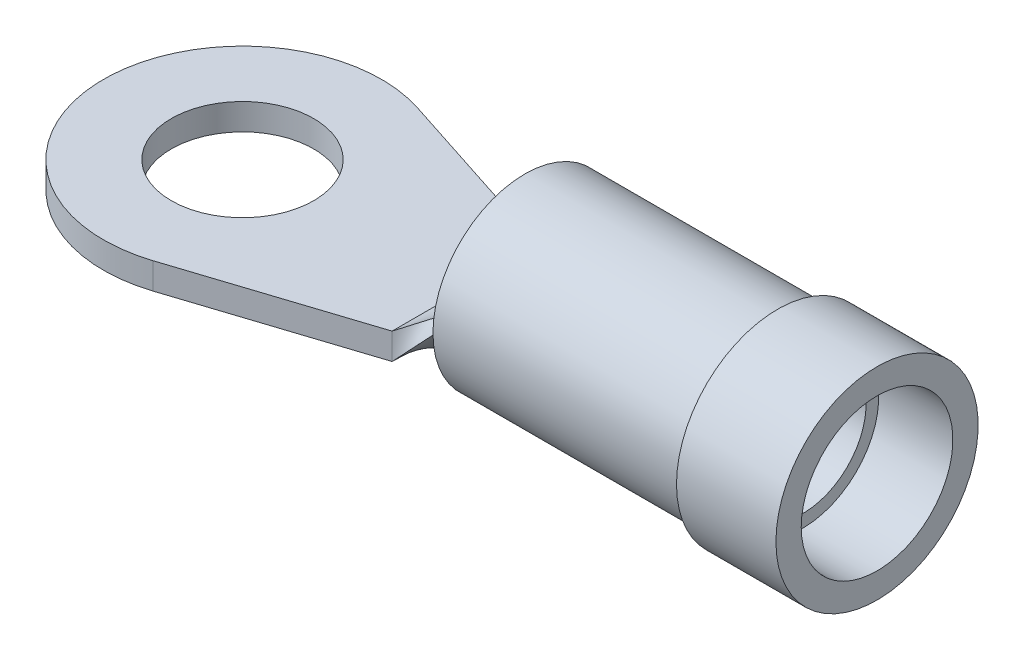
ISO-10303-21;
HEADER;
FILE_DESCRIPTION(('STEP AP214'),'2;1');
FILE_NAME('part.step','',(''),(''),'','','');
FILE_SCHEMA(('AUTOMOTIVE_DESIGN { 1 0 10303 214 1 1 1 1 }'));
ENDSEC;
DATA;
#1=APPLICATION_CONTEXT('core data for automotive mechanical design processes');
#2=APPLICATION_PROTOCOL_DEFINITION('international standard','automotive_design',2000,#1);
#3=PRODUCT_CONTEXT('',#1,'mechanical');
#4=PRODUCT('Part','Part','',(#3));
#5=PRODUCT_RELATED_PRODUCT_CATEGORY('part','',(#4));
#6=PRODUCT_DEFINITION_FORMATION('','',#4);
#7=PRODUCT_DEFINITION_CONTEXT('part definition',#1,'design');
#8=PRODUCT_DEFINITION('design','',#6,#7);
#9=PRODUCT_DEFINITION_SHAPE('','',#8);
#10=(LENGTH_UNIT() NAMED_UNIT(*) SI_UNIT(.MILLI.,.METRE.));
#11=(NAMED_UNIT(*) PLANE_ANGLE_UNIT() SI_UNIT($,.RADIAN.));
#12=(NAMED_UNIT(*) SI_UNIT($,.STERADIAN.) SOLID_ANGLE_UNIT());
#13=UNCERTAINTY_MEASURE_WITH_UNIT(LENGTH_MEASURE(1.E-05),#10,'distance_accuracy_value','');
#14=(GEOMETRIC_REPRESENTATION_CONTEXT(3) GLOBAL_UNCERTAINTY_ASSIGNED_CONTEXT((#13)) GLOBAL_UNIT_ASSIGNED_CONTEXT((#10,
#11,#12)) REPRESENTATION_CONTEXT('',''));
#15=CARTESIAN_POINT('',(0.,0.,0.));
#16=DIRECTION('',(0.,0.,1.));
#17=DIRECTION('',(1.,0.,0.));
#18=AXIS2_PLACEMENT_3D('',#15,#16,#17);
#19=CARTESIAN_POINT('',(8.509,-1.65735,0.));
#20=DIRECTION('',(-1.,0.,0.));
#21=DIRECTION('',(0.,0.,1.));
#22=AXIS2_PLACEMENT_3D('',#19,#20,#21);
#23=PLANE('',#22);
#24=CARTESIAN_POINT('',(8.509,1.11125,0.));
#25=DIRECTION('',(-1.,0.,0.));
#26=DIRECTION('',(0.,0.,1.));
#27=AXIS2_PLACEMENT_3D('',#24,#25,#26);
#28=CIRCLE('',#27,2.7686);
#29=CARTESIAN_POINT('',(8.509,1.11125,2.7686));
#30=VERTEX_POINT('',#29);
#31=EDGE_CURVE('E358',#30,#30,#28,.T.);
#32=ORIENTED_EDGE('',*,*,#31,.T.);
#33=EDGE_LOOP('',(#32));
#34=FACE_BOUND('',#33,.T.);
#35=CARTESIAN_POINT('',(8.509,1.11125,0.));
#36=DIRECTION('',(-1.,0.,0.));
#37=DIRECTION('',(0.,0.,1.));
#38=AXIS2_PLACEMENT_3D('',#35,#36,#37);
#39=CIRCLE('',#38,1.905);
#40=CARTESIAN_POINT('',(8.509,1.11125,1.905));
#41=VERTEX_POINT('',#40);
#42=EDGE_CURVE('E12',#41,#41,#39,.T.);
#43=ORIENTED_EDGE('',*,*,#42,.F.);
#44=EDGE_LOOP('',(#43));
#45=FACE_BOUND('',#44,.T.);
#46=ADVANCED_FACE('F330',(#34,#45),#23,.T.);
#47=CARTESIAN_POINT('',(5.55851083591331,1.11125,0.));
#48=DIRECTION('',(-1.,0.,0.));
#49=DIRECTION('',(0.,0.,1.));
#50=AXIS2_PLACEMENT_3D('',#47,#48,#49);
#51=CYLINDRICAL_SURFACE('',#50,1.905);
#52=ORIENTED_EDGE('',*,*,#42,.T.);
#53=EDGE_LOOP('',(#52));
#54=FACE_BOUND('',#53,.T.);
#55=CARTESIAN_POINT('',(16.891,1.11125,0.));
#56=DIRECTION('',(-1.,0.,0.));
#57=DIRECTION('',(0.,0.,1.));
#58=AXIS2_PLACEMENT_3D('',#55,#56,#57);
#59=CIRCLE('',#58,1.905);
#60=CARTESIAN_POINT('',(16.891,1.11125,1.905));
#61=VERTEX_POINT('',#60);
#62=EDGE_CURVE('E336',#61,#61,#59,.T.);
#63=ORIENTED_EDGE('',*,*,#62,.F.);
#64=EDGE_LOOP('',(#63));
#65=FACE_BOUND('',#64,.T.);
#66=ADVANCED_FACE('F376',(#54,#65),#51,.F.);
#67=CARTESIAN_POINT('',(16.891,-1.17475,0.));
#68=DIRECTION('',(1.,0.,0.));
#69=DIRECTION('',(0.,0.,-1.));
#70=AXIS2_PLACEMENT_3D('',#67,#68,#69);
#71=PLANE('',#70);
#72=ORIENTED_EDGE('',*,*,#62,.T.);
#73=EDGE_LOOP('',(#72));
#74=FACE_BOUND('',#73,.T.);
#75=CARTESIAN_POINT('',(16.891,1.11125,0.));
#76=DIRECTION('',(-1.,0.,0.));
#77=DIRECTION('',(0.,0.,1.));
#78=AXIS2_PLACEMENT_3D('',#75,#76,#77);
#79=CIRCLE('',#78,2.286);
#80=CARTESIAN_POINT('',(16.891,1.11125,2.286));
#81=VERTEX_POINT('',#80);
#82=EDGE_CURVE('E340',#81,#81,#79,.T.);
#83=ORIENTED_EDGE('',*,*,#82,.F.);
#84=EDGE_LOOP('',(#83));
#85=FACE_BOUND('',#84,.T.);
#86=ADVANCED_FACE('F380',(#74,#85),#71,.T.);
#87=CARTESIAN_POINT('',(5.55851083591331,1.11125,0.));
#88=DIRECTION('',(-1.,0.,0.));
#89=DIRECTION('',(0.,0.,1.));
#90=AXIS2_PLACEMENT_3D('',#87,#88,#89);
#91=CYLINDRICAL_SURFACE('',#90,2.286);
#92=ORIENTED_EDGE('',*,*,#82,.T.);
#93=EDGE_LOOP('',(#92));
#94=FACE_BOUND('',#93,.T.);
#95=CARTESIAN_POINT('',(19.1262,1.11125,0.));
#96=DIRECTION('',(-1.,0.,0.));
#97=DIRECTION('',(0.,0.,1.));
#98=AXIS2_PLACEMENT_3D('',#95,#96,#97);
#99=CIRCLE('',#98,2.286);
#100=CARTESIAN_POINT('',(19.1262,1.11125,2.286));
#101=VERTEX_POINT('',#100);
#102=EDGE_CURVE('E344',#101,#101,#99,.T.);
#103=ORIENTED_EDGE('',*,*,#102,.F.);
#104=EDGE_LOOP('',(#103));
#105=FACE_BOUND('',#104,.T.);
#106=ADVANCED_FACE('F384',(#94,#105),#91,.F.);
#107=CARTESIAN_POINT('',(19.1262,-1.93675,0.));
#108=DIRECTION('',(1.,0.,0.));
#109=DIRECTION('',(0.,0.,-1.));
#110=AXIS2_PLACEMENT_3D('',#107,#108,#109);
#111=PLANE('',#110);
#112=ORIENTED_EDGE('',*,*,#102,.T.);
#113=EDGE_LOOP('',(#112));
#114=FACE_BOUND('',#113,.T.);
#115=CARTESIAN_POINT('',(19.1262,1.11125,0.));
#116=DIRECTION('',(-1.,0.,0.));
#117=DIRECTION('',(0.,0.,1.));
#118=AXIS2_PLACEMENT_3D('',#115,#116,#117);
#119=CIRCLE('',#118,3.048);
#120=CARTESIAN_POINT('',(19.1262,1.11125,3.048));
#121=VERTEX_POINT('',#120);
#122=EDGE_CURVE('E349',#121,#121,#119,.T.);
#123=ORIENTED_EDGE('',*,*,#122,.F.);
#124=EDGE_LOOP('',(#123));
#125=FACE_BOUND('',#124,.T.);
#126=ADVANCED_FACE('F390',(#114,#125),#111,.T.);
#127=CARTESIAN_POINT('',(5.55851083591331,1.11125,0.));
#128=DIRECTION('',(-1.,0.,0.));
#129=DIRECTION('',(0.,0.,1.));
#130=AXIS2_PLACEMENT_3D('',#127,#128,#129);
#131=CYLINDRICAL_SURFACE('',#130,3.048);
#132=ORIENTED_EDGE('',*,*,#122,.T.);
#133=EDGE_LOOP('',(#132));
#134=FACE_BOUND('',#133,.T.);
#135=CARTESIAN_POINT('',(16.129,1.11125,0.));
#136=DIRECTION('',(-1.,0.,0.));
#137=DIRECTION('',(0.,0.,1.));
#138=AXIS2_PLACEMENT_3D('',#135,#136,#137);
#139=CIRCLE('',#138,3.048);
#140=CARTESIAN_POINT('',(16.129,1.11125,3.048));
#141=VERTEX_POINT('',#140);
#142=EDGE_CURVE('E352',#141,#141,#139,.T.);
#143=ORIENTED_EDGE('',*,*,#142,.F.);
#144=EDGE_LOOP('',(#143));
#145=FACE_BOUND('',#144,.T.);
#146=ADVANCED_FACE('F372',(#134,#145),#131,.T.);
#147=CARTESIAN_POINT('',(16.129,-1.93675,0.));
#148=DIRECTION('',(-1.,0.,0.));
#149=DIRECTION('',(0.,0.,1.));
#150=AXIS2_PLACEMENT_3D('',#147,#148,#149);
#151=PLANE('',#150);
#152=ORIENTED_EDGE('',*,*,#142,.T.);
#153=EDGE_LOOP('',(#152));
#154=FACE_BOUND('',#153,.T.);
#155=CARTESIAN_POINT('',(16.129,1.11125,0.));
#156=DIRECTION('',(-1.,0.,0.));
#157=DIRECTION('',(0.,0.,1.));
#158=AXIS2_PLACEMENT_3D('',#155,#156,#157);
#159=CIRCLE('',#158,2.7686);
#160=CARTESIAN_POINT('',(16.129,1.11125,2.7686));
#161=VERTEX_POINT('',#160);
#162=EDGE_CURVE('E355',#161,#161,#159,.T.);
#163=ORIENTED_EDGE('',*,*,#162,.F.);
#164=EDGE_LOOP('',(#163));
#165=FACE_BOUND('',#164,.T.);
#166=ADVANCED_FACE('F366',(#154,#165),#151,.T.);
#167=CARTESIAN_POINT('',(5.55851083591331,1.11125,0.));
#168=DIRECTION('',(-1.,0.,0.));
#169=DIRECTION('',(0.,0.,1.));
#170=AXIS2_PLACEMENT_3D('',#167,#168,#169);
#171=CYLINDRICAL_SURFACE('',#170,2.7686);
#172=ORIENTED_EDGE('',*,*,#162,.T.);
#173=EDGE_LOOP('',(#172));
#174=FACE_BOUND('',#173,.T.);
#175=ORIENTED_EDGE('',*,*,#31,.F.);
#176=EDGE_LOOP('',(#175));
#177=FACE_BOUND('',#176,.T.);
#178=ADVANCED_FACE('F364',(#174,#177),#171,.T.);
#179=CLOSED_SHELL('',(#46,#66,#86,#106,#126,#146,#166,#178));
#180=MANIFOLD_SOLID_BREP('B2',#179);
#181=CARTESIAN_POINT('',(6.731,-0.79375,-2.2225));
#182=DIRECTION('',(0.308564956886749,0.,-0.951203273428702));
#183=DIRECTION('',(-0.951203273428702,0.,-0.308564956886749));
#184=AXIS2_PLACEMENT_3D('',#181,#182,#183);
#185=PLANE('',#184);
#186=DIRECTION('',(-0.951203273428702,0.,-0.308564956886749));
#187=VECTOR('',#186,1.);
#188=CARTESIAN_POINT('',(6.731,0.,-2.2225));
#189=LINE('',#188,#187);
#190=CARTESIAN_POINT('',(6.731,0.,-2.2225));
#191=VERTEX_POINT('',#190);
#192=CARTESIAN_POINT('',(1.29319573431237,0.,-3.98649291893969));
#193=VERTEX_POINT('',#192);
#194=EDGE_CURVE('E670',#191,#193,#189,.T.);
#195=ORIENTED_EDGE('',*,*,#194,.F.);
#196=DIRECTION('',(0.,1.,0.));
#197=VECTOR('',#196,1.);
#198=CARTESIAN_POINT('',(6.731,-0.79375,-2.2225));
#199=LINE('',#198,#197);
#200=CARTESIAN_POINT('',(6.731,-0.79375,-2.2225));
#201=VERTEX_POINT('',#200);
#202=EDGE_CURVE('E328',#201,#191,#199,.T.);
#203=ORIENTED_EDGE('',*,*,#202,.F.);
#204=DIRECTION('',(-0.951203273428702,0.,-0.308564956886749));
#205=VECTOR('',#204,1.);
#206=CARTESIAN_POINT('',(6.731,-0.79375,-2.2225));
#207=LINE('',#206,#205);
#208=CARTESIAN_POINT('',(1.29319573431237,-0.79375,-3.98649291893969));
#209=VERTEX_POINT('',#208);
#210=EDGE_CURVE('E674',#201,#209,#207,.T.);
#211=ORIENTED_EDGE('',*,*,#210,.T.);
#212=DIRECTION('',(0.,1.,0.));
#213=VECTOR('',#212,1.);
#214=CARTESIAN_POINT('',(1.29319573431237,-0.79375,-3.98649291893969));
#215=LINE('',#214,#213);
#216=EDGE_CURVE('E498',#209,#193,#215,.T.);
#217=ORIENTED_EDGE('',*,*,#216,.T.);
#218=EDGE_LOOP('',(#195,#203,#211,#217));
#219=FACE_BOUND('',#218,.T.);
#220=ADVANCED_FACE('F451',(#219),#185,.T.);
#221=CARTESIAN_POINT('',(6.731,-0.79375,2.2225));
#222=DIRECTION('',(0.308564956886749,0.,0.951203273428702));
#223=DIRECTION('',(0.951203273428702,0.,-0.308564956886749));
#224=AXIS2_PLACEMENT_3D('',#221,#222,#223);
#225=PLANE('',#224);
#226=DIRECTION('',(0.951203273428702,0.,-0.308564956886749));
#227=VECTOR('',#226,1.);
#228=CARTESIAN_POINT('',(6.731,0.,2.2225));
#229=LINE('',#228,#227);
#230=CARTESIAN_POINT('',(1.29319573431237,0.,3.98649291893969));
#231=VERTEX_POINT('',#230);
#232=CARTESIAN_POINT('',(6.731,0.,2.2225));
#233=VERTEX_POINT('',#232);
#234=EDGE_CURVE('E686',#231,#233,#229,.T.);
#235=ORIENTED_EDGE('',*,*,#234,.F.);
#236=DIRECTION('',(0.,1.,0.));
#237=VECTOR('',#236,1.);
#238=CARTESIAN_POINT('',(1.29319573431237,-0.79375,3.98649291893969));
#239=LINE('',#238,#237);
#240=CARTESIAN_POINT('',(1.29319573431237,-0.79375,3.98649291893969));
#241=VERTEX_POINT('',#240);
#242=EDGE_CURVE('E690',#241,#231,#239,.T.);
#243=ORIENTED_EDGE('',*,*,#242,.F.);
#244=DIRECTION('',(0.951203273428702,0.,-0.308564956886749));
#245=VECTOR('',#244,1.);
#246=CARTESIAN_POINT('',(6.731,-0.79375,2.2225));
#247=LINE('',#246,#245);
#248=CARTESIAN_POINT('',(6.731,-0.79375,2.2225));
#249=VERTEX_POINT('',#248);
#250=EDGE_CURVE('E678',#241,#249,#247,.T.);
#251=ORIENTED_EDGE('',*,*,#250,.T.);
#252=DIRECTION('',(0.,1.,0.));
#253=VECTOR('',#252,1.);
#254=CARTESIAN_POINT('',(6.731,-0.79375,2.2225));
#255=LINE('',#254,#253);
#256=EDGE_CURVE('E459',#249,#233,#255,.T.);
#257=ORIENTED_EDGE('',*,*,#256,.T.);
#258=EDGE_LOOP('',(#235,#243,#251,#257));
#259=FACE_BOUND('',#258,.T.);
#260=ADVANCED_FACE('F696',(#259),#225,.T.);
#261=CARTESIAN_POINT('',(0.,-0.79375,0.));
#262=DIRECTION('',(0.,1.,0.));
#263=DIRECTION('',(0.,0.,1.));
#264=AXIS2_PLACEMENT_3D('',#261,#262,#263);
#265=CYLINDRICAL_SURFACE('',#264,4.191);
#266=CARTESIAN_POINT('',(0.,0.,0.));
#267=DIRECTION('',(0.,1.,0.));
#268=DIRECTION('',(0.,0.,1.));
#269=AXIS2_PLACEMENT_3D('',#266,#267,#268);
#270=CIRCLE('',#269,4.191);
#271=EDGE_CURVE('E683',#193,#231,#270,.T.);
#272=ORIENTED_EDGE('',*,*,#271,.F.);
#273=ORIENTED_EDGE('',*,*,#216,.F.);
#274=CARTESIAN_POINT('',(0.,-0.79375,0.));
#275=DIRECTION('',(0.,1.,0.));
#276=DIRECTION('',(0.,0.,1.));
#277=AXIS2_PLACEMENT_3D('',#274,#275,#276);
#278=CIRCLE('',#277,4.191);
#279=EDGE_CURVE('E676',#209,#241,#278,.T.);
#280=ORIENTED_EDGE('',*,*,#279,.T.);
#281=ORIENTED_EDGE('',*,*,#242,.T.);
#282=EDGE_LOOP('',(#272,#273,#280,#281));
#283=FACE_BOUND('',#282,.T.);
#284=ADVANCED_FACE('F695',(#283),#265,.T.);
#285=CARTESIAN_POINT('',(0.,-0.79375,0.));
#286=DIRECTION('',(0.,1.,0.));
#287=DIRECTION('',(0.,0.,1.));
#288=AXIS2_PLACEMENT_3D('',#285,#286,#287);
#289=PLANE('',#288);
#290=CARTESIAN_POINT('',(0.,-0.79375,0.));
#291=DIRECTION('',(0.,1.,0.));
#292=DIRECTION('',(0.,0.,1.));
#293=AXIS2_PLACEMENT_3D('',#290,#291,#292);
#294=CIRCLE('',#293,2.1463);
#295=CARTESIAN_POINT('',(0.,-0.79375,2.1463));
#296=VERTEX_POINT('',#295);
#297=EDGE_CURVE('E667',#296,#296,#294,.T.);
#298=ORIENTED_EDGE('',*,*,#297,.T.);
#299=EDGE_LOOP('',(#298));
#300=FACE_BOUND('',#299,.T.);
#301=ORIENTED_EDGE('',*,*,#210,.F.);
#302=DIRECTION('',(0.,0.,-1.));
#303=VECTOR('',#302,1.);
#304=CARTESIAN_POINT('',(6.731,-0.79375,2.2225));
#305=LINE('',#304,#303);
#306=CARTESIAN_POINT('',(6.731,-0.79375,0.));
#307=VERTEX_POINT('',#306);
#308=EDGE_CURVE('E467',#307,#201,#305,.T.);
#309=ORIENTED_EDGE('',*,*,#308,.F.);
#310=DIRECTION('',(0.,0.,-1.));
#311=VECTOR('',#310,1.);
#312=CARTESIAN_POINT('',(6.731,-0.79375,-2.2225));
#313=LINE('',#312,#311);
#314=EDGE_CURVE('E661',#249,#307,#313,.T.);
#315=ORIENTED_EDGE('',*,*,#314,.F.);
#316=ORIENTED_EDGE('',*,*,#250,.F.);
#317=ORIENTED_EDGE('',*,*,#279,.F.);
#318=EDGE_LOOP('',(#301,#309,#315,#316,#317));
#319=FACE_BOUND('',#318,.T.);
#320=ADVANCED_FACE('F694',(#300,#319),#289,.F.);
#321=CARTESIAN_POINT('',(0.,0.,0.));
#322=DIRECTION('',(0.,1.,0.));
#323=DIRECTION('',(0.,0.,1.));
#324=AXIS2_PLACEMENT_3D('',#321,#322,#323);
#325=PLANE('',#324);
#326=CARTESIAN_POINT('',(0.,0.,0.));
#327=DIRECTION('',(0.,1.,0.));
#328=DIRECTION('',(0.,0.,1.));
#329=AXIS2_PLACEMENT_3D('',#326,#327,#328);
#330=CIRCLE('',#329,2.1463);
#331=CARTESIAN_POINT('',(0.,0.,2.1463));
#332=VERTEX_POINT('',#331);
#333=EDGE_CURVE('E671',#332,#332,#330,.T.);
#334=ORIENTED_EDGE('',*,*,#333,.F.);
#335=EDGE_LOOP('',(#334));
#336=FACE_BOUND('',#335,.T.);
#337=ORIENTED_EDGE('',*,*,#194,.T.);
#338=ORIENTED_EDGE('',*,*,#271,.T.);
#339=ORIENTED_EDGE('',*,*,#234,.T.);
#340=DIRECTION('',(0.,0.,-1.));
#341=VECTOR('',#340,1.);
#342=CARTESIAN_POINT('',(6.731,0.,-2.2225));
#343=LINE('',#342,#341);
#344=EDGE_CURVE('E625',#233,#191,#343,.T.);
#345=ORIENTED_EDGE('',*,*,#344,.T.);
#346=EDGE_LOOP('',(#337,#338,#339,#345));
#347=FACE_BOUND('',#346,.T.);
#348=ADVANCED_FACE('F698',(#336,#347),#325,.T.);
#349=CARTESIAN_POINT('',(0.,-0.79375,0.));
#350=DIRECTION('',(0.,1.,0.));
#351=DIRECTION('',(0.,0.,1.));
#352=AXIS2_PLACEMENT_3D('',#349,#350,#351);
#353=CYLINDRICAL_SURFACE('',#352,2.1463);
#354=ORIENTED_EDGE('',*,*,#297,.F.);
#355=EDGE_LOOP('',(#354));
#356=FACE_BOUND('',#355,.T.);
#357=ORIENTED_EDGE('',*,*,#333,.T.);
#358=EDGE_LOOP('',(#357));
#359=FACE_BOUND('',#358,.T.);
#360=ADVANCED_FACE('F733',(#356,#359),#353,.F.);
#361=CARTESIAN_POINT('',(8.509,1.11125,1.905));
#362=CARTESIAN_POINT('',(6.731,-0.79375,2.2225));
#363=CARTESIAN_POINT('',(8.509,1.11125,1.11125));
#364=CARTESIAN_POINT('',(6.731,0.,2.2225));
#365=B_SPLINE_SURFACE_WITH_KNOTS('',1,1,((#361,#362),(#363,#364)),.UNSPECIFIED.,.F.,.F.,.F.,(2,
2),(2,2),(0.,1.),(0.,1.),.UNSPECIFIED.);
#366=DIRECTION('',(0.,0.,-1.));
#367=VECTOR('',#366,1.);
#368=CARTESIAN_POINT('',(8.509,1.11125,1.11125));
#369=LINE('',#368,#367);
#370=CARTESIAN_POINT('',(8.509,1.11125,1.905));
#371=VERTEX_POINT('',#370);
#372=CARTESIAN_POINT('',(8.509,1.11125,1.11125));
#373=VERTEX_POINT('',#372);
#374=EDGE_CURVE('E551',#371,#373,#369,.T.);
#375=DIRECTION('',(-0.749268649265355,-0.468292905790847,0.468292905790847));
#376=VECTOR('',#375,1.);
#377=CARTESIAN_POINT('',(7.62,0.555625,1.666875));
#378=LINE('',#377,#376);
#379=EDGE_CURVE('E613',#373,#233,#378,.T.);
#380=DIRECTION('',(0.677309239368804,0.72568847075229,-0.120948078458715));
#381=VECTOR('',#380,1.);
#382=CARTESIAN_POINT('',(7.62,0.15875,2.06375));
#383=LINE('',#382,#381);
#384=EDGE_CURVE('E620',#249,#371,#383,.T.);
#385=ORIENTED_EDGE('',*,*,#374,.T.);
#386=ORIENTED_EDGE('',*,*,#379,.T.);
#387=ORIENTED_EDGE('',*,*,#256,.F.);
#388=ORIENTED_EDGE('',*,*,#384,.T.);
#389=EDGE_LOOP('',(#385,#386,#387,#388));
#390=FACE_BOUND('',#389,.T.);
#391=ADVANCED_FACE('F618',(#390),#365,.T.);
#392=CARTESIAN_POINT('',(8.509,1.11125,1.11125));
#393=CARTESIAN_POINT('',(6.731,0.,2.2225));
#394=CARTESIAN_POINT('',(8.509,-1.11125,1.11125));
#395=CARTESIAN_POINT('',(6.731,0.,0.740833333333333));
#396=CARTESIAN_POINT('',(8.509,-1.11125,-1.11125));
#397=CARTESIAN_POINT('',(6.731,0.,-0.740833333333333));
#398=CARTESIAN_POINT('',(8.509,1.11125,-1.11125));
#399=CARTESIAN_POINT('',(6.731,0.,-2.2225));
#400=(BOUNDED_SURFACE() B_SPLINE_SURFACE(3,1,((#392,#393),(#394,#395),(#396,#397),(#398,#399)),
.UNSPECIFIED.,.F.,.F.,.F.) B_SPLINE_SURFACE_WITH_KNOTS((4,4),(2,2),(0.,1.),(0.,1.),
.UNSPECIFIED.) GEOMETRIC_REPRESENTATION_ITEM() RATIONAL_B_SPLINE_SURFACE(((1.,1.),
(0.333333333333333,1.),(0.333333333333333,1.),(1.,1.))) REPRESENTATION_ITEM('') SURFACE());
#401=CARTESIAN_POINT('',(8.509,1.11125,0.));
#402=DIRECTION('',(1.,0.,0.));
#403=DIRECTION('',(0.,0.,1.));
#404=AXIS2_PLACEMENT_3D('',#401,#402,#403);
#405=CIRCLE('',#404,1.11125);
#406=CARTESIAN_POINT('',(8.509,1.11125,-1.11125));
#407=VERTEX_POINT('',#406);
#408=EDGE_CURVE('E608',#373,#407,#405,.T.);
#409=DIRECTION('',(-0.749268649265355,-0.468292905790847,-0.468292905790847));
#410=VECTOR('',#409,1.);
#411=CARTESIAN_POINT('',(7.62,0.555625,-1.666875));
#412=LINE('',#411,#410);
#413=EDGE_CURVE('E627',#407,#191,#412,.T.);
#414=ORIENTED_EDGE('',*,*,#408,.T.);
#415=ORIENTED_EDGE('',*,*,#413,.T.);
#416=ORIENTED_EDGE('',*,*,#344,.F.);
#417=ORIENTED_EDGE('',*,*,#379,.F.);
#418=EDGE_LOOP('',(#414,#415,#416,#417));
#419=FACE_BOUND('',#418,.T.);
#420=ADVANCED_FACE('F624',(#419),#400,.T.);
#421=CARTESIAN_POINT('',(8.509,-0.79375,0.));
#422=CARTESIAN_POINT('',(8.41022222222222,-0.79375,0.));
#423=CARTESIAN_POINT('',(8.21266666666667,-0.79375,0.));
#424=CARTESIAN_POINT('',(7.81755555555555,-0.79375,0.));
#425=CARTESIAN_POINT('',(7.42244444444444,-0.79375,0.));
#426=CARTESIAN_POINT('',(7.02733333333333,-0.79375,0.));
#427=CARTESIAN_POINT('',(6.82977777777778,-0.79375,0.));
#428=CARTESIAN_POINT('',(6.731,-0.79375,0.));
#429=CARTESIAN_POINT('',(8.509,-0.79375,1.11592316367925));
#430=CARTESIAN_POINT('',(8.40991296405613,-0.79375,1.09070453109773));
#431=CARTESIAN_POINT('',(8.21878079099716,-0.79375,1.04205949897049));
#432=CARTESIAN_POINT('',(7.82737310367948,-0.79375,0.956413276308467));
#433=CARTESIAN_POINT('',(7.43198276687647,-0.79375,0.873774853788421));
#434=CARTESIAN_POINT('',(7.03247335142687,-0.79375,0.794056522880565));
#435=CARTESIAN_POINT('',(6.82952890602483,-0.79375,0.758227980709033));
#436=CARTESIAN_POINT('',(6.731,-0.79375,0.740833333333333));
#437=CARTESIAN_POINT('',(8.509,-0.00467316367925414,1.905));
#438=CARTESIAN_POINT('',(8.38529601403522,-0.0595730230073494,1.87554667000839));
#439=CARTESIAN_POINT('',(8.14667941370722,-0.16547112878937,1.81873319373981));
#440=CARTESIAN_POINT('',(7.73066209280174,-0.350099717897766,1.71968145066708));
#441=CARTESIAN_POINT('',(7.33802236119927,-0.524353327136632,1.62619580028554));
#442=CARTESIAN_POINT('',(6.97185921213121,-0.686856622549381,1.53901409812648));
#443=CARTESIAN_POINT('',(6.80971871448991,-0.758814615191824,1.50040921773569));
#444=CARTESIAN_POINT('',(6.731,-0.79375,1.48166666666667));
#445=CARTESIAN_POINT('',(8.509,1.11125,1.905));
#446=CARTESIAN_POINT('',(8.41022222222222,1.00541666666667,1.92263888888889));
#447=CARTESIAN_POINT('',(8.21266666666667,0.79375,1.95791666666667));
#448=CARTESIAN_POINT('',(7.81755555555555,0.370416666666667,2.02847222222222));
#449=CARTESIAN_POINT('',(7.42244444444444,-0.0529166666666667,2.09902777777778));
#450=CARTESIAN_POINT('',(7.02733333333333,-0.47625,2.16958333333333));
#451=CARTESIAN_POINT('',(6.82977777777778,-0.687916666666667,2.20486111111111));
#452=CARTESIAN_POINT('',(6.731,-0.79375,2.2225));
#453=(BOUNDED_SURFACE() B_SPLINE_SURFACE(3,3,((#421,#422,#423,#424,#425,#426,#427,#428),(#429,
#430,#431,#432,#433,#434,#435,#436),(#437,#438,#439,#440,#441,#442,#443,#444),(#445,#446,#447,
#448,#449,#450,#451,#452)),.UNSPECIFIED.,.F.,.F.,.F.) B_SPLINE_SURFACE_WITH_KNOTS((4,4),(4,1,1,
1,1,4),(0.5,1.),(0.,0.166666666666667,0.333333333333333,0.666666666666667,0.833333333333333,1.),
.UNSPECIFIED.) GEOMETRIC_REPRESENTATION_ITEM() RATIONAL_B_SPLINE_SURFACE(((1.,1.,1.,1.,1.,1.,1.,
1.),(0.804737854124365,0.804737854124365,0.824264068711928,0.889351450670473,0.915386403453892,
0.980473785412436,1.,1.),(0.804737854124365,0.804737854124365,0.824264068711928,
0.889351450670473,0.915386403453892,0.980473785412436,1.,1.),(1.,1.,1.,1.,1.,1.,1.,1.))) REPRESENTATION_ITEM('') SURFACE());
#454=CARTESIAN_POINT('',(8.509,1.11125,0.));
#455=DIRECTION('',(-1.,0.,0.));
#456=DIRECTION('',(0.,0.,1.));
#457=AXIS2_PLACEMENT_3D('',#454,#455,#456);
#458=CIRCLE('',#457,1.905);
#459=CARTESIAN_POINT('',(8.509,-0.79375,0.));
#460=VERTEX_POINT('',#459);
#461=EDGE_CURVE('E621',#460,#371,#458,.T.);
#462=DIRECTION('',(-1.,0.,0.));
#463=VECTOR('',#462,1.);
#464=CARTESIAN_POINT('',(7.62,-0.79375,0.));
#465=LINE('',#464,#463);
#466=EDGE_CURVE('E646',#460,#307,#465,.T.);
#467=ORIENTED_EDGE('',*,*,#461,.T.);
#468=ORIENTED_EDGE('',*,*,#384,.F.);
#469=ORIENTED_EDGE('',*,*,#314,.T.);
#470=ORIENTED_EDGE('',*,*,#466,.F.);
#471=EDGE_LOOP('',(#467,#468,#469,#470));
#472=FACE_BOUND('',#471,.T.);
#473=ADVANCED_FACE('F692',(#472),#453,.T.);
#474=CARTESIAN_POINT('',(8.509,1.11125,-1.905));
#475=CARTESIAN_POINT('',(8.41022222222222,1.00541666666667,-1.92263888888889));
#476=CARTESIAN_POINT('',(8.21266666666667,0.79375,-1.95791666666667));
#477=CARTESIAN_POINT('',(7.81755555555555,0.370416666666667,-2.02847222222222));
#478=CARTESIAN_POINT('',(7.42244444444444,-0.0529166666666666,-2.09902777777778));
#479=CARTESIAN_POINT('',(7.02733333333333,-0.47625,-2.16958333333333));
#480=CARTESIAN_POINT('',(6.82977777777778,-0.687916666666667,-2.20486111111111));
#481=CARTESIAN_POINT('',(6.731,-0.79375,-2.2225));
#482=CARTESIAN_POINT('',(8.509,-0.00467316367925391,-1.905));
#483=CARTESIAN_POINT('',(8.38529601403522,-0.0595730230073492,-1.87554667000839));
#484=CARTESIAN_POINT('',(8.14667941370722,-0.16547112878937,-1.81873319373981));
#485=CARTESIAN_POINT('',(7.73066209280174,-0.350099717897765,-1.71968145066708));
#486=CARTESIAN_POINT('',(7.33802236119927,-0.524353327136632,-1.62619580028554));
#487=CARTESIAN_POINT('',(6.97185921213121,-0.686856622549381,-1.53901409812648));
#488=CARTESIAN_POINT('',(6.80971871448991,-0.758814615191824,-1.50040921773569));
#489=CARTESIAN_POINT('',(6.731,-0.79375,-1.48166666666667));
#490=CARTESIAN_POINT('',(8.509,-0.79375,-1.11592316367925));
#491=CARTESIAN_POINT('',(8.40991296405613,-0.79375,-1.09070453109773));
#492=CARTESIAN_POINT('',(8.21878079099716,-0.79375,-1.04205949897049));
#493=CARTESIAN_POINT('',(7.82737310367948,-0.79375,-0.956413276308468));
#494=CARTESIAN_POINT('',(7.43198276687647,-0.79375,-0.873774853788421));
#495=CARTESIAN_POINT('',(7.03247335142687,-0.79375,-0.794056522880565));
#496=CARTESIAN_POINT('',(6.82952890602483,-0.79375,-0.758227980709033));
#497=CARTESIAN_POINT('',(6.731,-0.79375,-0.740833333333333));
#498=CARTESIAN_POINT('',(8.509,-0.79375,0.));
#499=CARTESIAN_POINT('',(8.41022222222222,-0.79375,0.));
#500=CARTESIAN_POINT('',(8.21266666666667,-0.79375,0.));
#501=CARTESIAN_POINT('',(7.81755555555555,-0.79375,0.));
#502=CARTESIAN_POINT('',(7.42244444444444,-0.79375,0.));
#503=CARTESIAN_POINT('',(7.02733333333333,-0.79375,0.));
#504=CARTESIAN_POINT('',(6.82977777777778,-0.79375,0.));
#505=CARTESIAN_POINT('',(6.731,-0.79375,0.));
#506=(BOUNDED_SURFACE() B_SPLINE_SURFACE(3,3,((#474,#475,#476,#477,#478,#479,#480,#481),(#482,
#483,#484,#485,#486,#487,#488,#489),(#490,#491,#492,#493,#494,#495,#496,#497),(#498,#499,#500,
#501,#502,#503,#504,#505)),.UNSPECIFIED.,.F.,.F.,.F.) B_SPLINE_SURFACE_WITH_KNOTS((4,4),(4,1,1,
1,1,4),(0.,0.5),(0.,0.166666666666667,0.333333333333333,0.666666666666667,0.833333333333333,1.),
.UNSPECIFIED.) GEOMETRIC_REPRESENTATION_ITEM() RATIONAL_B_SPLINE_SURFACE(((1.,1.,1.,1.,1.,1.,1.,
1.),(0.804737854124365,0.804737854124365,0.824264068711928,0.889351450670473,0.915386403453892,
0.980473785412436,1.,1.),(0.804737854124365,0.804737854124365,0.824264068711928,
0.889351450670473,0.915386403453892,0.980473785412436,1.,1.),(1.,1.,1.,1.,1.,1.,1.,1.))) REPRESENTATION_ITEM('') SURFACE());
#507=CARTESIAN_POINT('',(8.509,1.11125,-1.905));
#508=VERTEX_POINT('',#507);
#509=EDGE_CURVE('E633',#508,#460,#458,.T.);
#510=DIRECTION('',(-0.677309239368804,-0.72568847075229,-0.120948078458715));
#511=VECTOR('',#510,1.);
#512=CARTESIAN_POINT('',(7.62,0.15875,-2.06375));
#513=LINE('',#512,#511);
#514=EDGE_CURVE('E648',#508,#201,#513,.T.);
#515=ORIENTED_EDGE('',*,*,#509,.T.);
#516=ORIENTED_EDGE('',*,*,#466,.T.);
#517=ORIENTED_EDGE('',*,*,#308,.T.);
#518=ORIENTED_EDGE('',*,*,#514,.F.);
#519=EDGE_LOOP('',(#515,#516,#517,#518));
#520=FACE_BOUND('',#519,.T.);
#521=ADVANCED_FACE('F703',(#520),#506,.T.);
#522=CARTESIAN_POINT('',(8.509,1.11125,-1.11125));
#523=CARTESIAN_POINT('',(6.731,0.,-2.2225));
#524=CARTESIAN_POINT('',(8.509,1.11125,-1.905));
#525=CARTESIAN_POINT('',(6.731,-0.79375,-2.2225));
#526=B_SPLINE_SURFACE_WITH_KNOTS('',1,1,((#522,#523),(#524,#525)),.UNSPECIFIED.,.F.,.F.,.F.,(2,
2),(2,2),(0.,1.),(0.,1.),.UNSPECIFIED.);
#527=DIRECTION('',(0.,0.,-1.));
#528=VECTOR('',#527,1.);
#529=CARTESIAN_POINT('',(8.509,1.11125,-1.11125));
#530=LINE('',#529,#528);
#531=EDGE_CURVE('E641',#407,#508,#530,.T.);
#532=ORIENTED_EDGE('',*,*,#531,.T.);
#533=ORIENTED_EDGE('',*,*,#514,.T.);
#534=ORIENTED_EDGE('',*,*,#202,.T.);
#535=ORIENTED_EDGE('',*,*,#413,.F.);
#536=EDGE_LOOP('',(#532,#533,#534,#535));
#537=FACE_BOUND('',#536,.T.);
#538=ADVANCED_FACE('F701',(#537),#526,.T.);
#539=CARTESIAN_POINT('',(8.509,2.22144233623284,-0.0484720442097223));
#540=DIRECTION('',(-1.,0.,0.));
#541=DIRECTION('',(0.,0.,1.));
#542=AXIS2_PLACEMENT_3D('',#539,#540,#541);
#543=PLANE('',#542);
#544=ORIENTED_EDGE('',*,*,#374,.F.);
#545=CARTESIAN_POINT('',(8.509,1.11125,0.));
#546=DIRECTION('',(-1.,0.,0.));
#547=DIRECTION('',(0.,0.,1.));
#548=AXIS2_PLACEMENT_3D('',#545,#546,#547);
#549=CIRCLE('',#548,1.905);
#550=CARTESIAN_POINT('',(8.509,3.01443686211344,0.0830949329309525));
#551=VERTEX_POINT('',#550);
#552=EDGE_CURVE('E545',#371,#551,#549,.T.);
#553=ORIENTED_EDGE('',*,*,#552,.T.);
#554=DIRECTION('',(0.,0.999048221581858,0.0436193873653294));
#555=VECTOR('',#554,1.);
#556=CARTESIAN_POINT('',(8.509,2.22144233623284,0.0484720442097223));
#557=LINE('',#556,#555);
#558=CARTESIAN_POINT('',(8.509,2.22144233623284,0.0484720442097223));
#559=VERTEX_POINT('',#558);
#560=EDGE_CURVE('E548',#559,#551,#557,.T.);
#561=ORIENTED_EDGE('',*,*,#560,.F.);
#562=CARTESIAN_POINT('',(8.509,1.11125,0.));
#563=DIRECTION('',(-1.,0.,0.));
#564=DIRECTION('',(0.,0.,1.));
#565=AXIS2_PLACEMENT_3D('',#562,#563,#564);
#566=CIRCLE('',#565,1.11125);
#567=EDGE_CURVE('E585',#373,#559,#566,.T.);
#568=ORIENTED_EDGE('',*,*,#567,.F.);
#569=EDGE_LOOP('',(#544,#553,#561,#568));
#570=FACE_BOUND('',#569,.T.);
#571=ADVANCED_FACE('F547',(#570),#543,.T.);
#572=ORIENTED_EDGE('',*,*,#531,.F.);
#573=CARTESIAN_POINT('',(8.509,2.22144233623284,-0.0484720442097223));
#574=VERTEX_POINT('',#573);
#575=EDGE_CURVE('E594',#574,#407,#566,.T.);
#576=ORIENTED_EDGE('',*,*,#575,.F.);
#577=DIRECTION('',(0.,0.999048221581858,-0.0436193873653294));
#578=VECTOR('',#577,1.);
#579=CARTESIAN_POINT('',(8.509,2.22144233623284,-0.0484720442097223));
#580=LINE('',#579,#578);
#581=CARTESIAN_POINT('',(8.509,3.01443686211344,-0.0830949329309525));
#582=VERTEX_POINT('',#581);
#583=EDGE_CURVE('E574',#574,#582,#580,.T.);
#584=ORIENTED_EDGE('',*,*,#583,.T.);
#585=EDGE_CURVE('E555',#582,#508,#549,.T.);
#586=ORIENTED_EDGE('',*,*,#585,.T.);
#587=EDGE_LOOP('',(#572,#576,#584,#586));
#588=FACE_BOUND('',#587,.T.);
#589=ADVANCED_FACE('F708',(#588),#543,.T.);
#590=CARTESIAN_POINT('',(6.5460439628483,1.11125,0.));
#591=DIRECTION('',(-1.,0.,0.));
#592=DIRECTION('',(0.,0.,1.));
#593=AXIS2_PLACEMENT_3D('',#590,#591,#592);
#594=CYLINDRICAL_SURFACE('',#593,1.905);
#595=CARTESIAN_POINT('',(12.827,1.11125,0.));
#596=DIRECTION('',(-1.,0.,0.));
#597=DIRECTION('',(0.,0.,1.));
#598=AXIS2_PLACEMENT_3D('',#595,#596,#597);
#599=CIRCLE('',#598,1.905);
#600=CARTESIAN_POINT('',(12.827,3.01443686211344,-0.0830949329309525));
#601=VERTEX_POINT('',#600);
#602=CARTESIAN_POINT('',(12.827,3.01443686211344,0.0830949329309525));
#603=VERTEX_POINT('',#602);
#604=EDGE_CURVE('E556',#601,#603,#599,.T.);
#605=ORIENTED_EDGE('',*,*,#604,.T.);
#606=DIRECTION('',(1.,0.,0.));
#607=VECTOR('',#606,1.);
#608=CARTESIAN_POINT('',(8.509,3.01443686211344,0.0830949329309525));
#609=LINE('',#608,#607);
#610=EDGE_CURVE('E562',#551,#603,#609,.T.);
#611=ORIENTED_EDGE('',*,*,#610,.F.);
#612=ORIENTED_EDGE('',*,*,#552,.F.);
#613=ORIENTED_EDGE('',*,*,#461,.F.);
#614=ORIENTED_EDGE('',*,*,#509,.F.);
#615=ORIENTED_EDGE('',*,*,#585,.F.);
#616=DIRECTION('',(1.,0.,0.));
#617=VECTOR('',#616,1.);
#618=CARTESIAN_POINT('',(8.509,3.01443686211344,-0.0830949329309525));
#619=LINE('',#618,#617);
#620=EDGE_CURVE('E577',#582,#601,#619,.T.);
#621=ORIENTED_EDGE('',*,*,#620,.T.);
#622=EDGE_LOOP('',(#605,#611,#612,#613,#614,#615,#621));
#623=FACE_BOUND('',#622,.T.);
#624=ADVANCED_FACE('F567',(#623),#594,.T.);
#625=CARTESIAN_POINT('',(12.827,3.01443686211344,-0.0830949329309525));
#626=DIRECTION('',(1.,0.,0.));
#627=DIRECTION('',(0.,0.,-1.));
#628=AXIS2_PLACEMENT_3D('',#625,#626,#627);
#629=PLANE('',#628);
#630=CARTESIAN_POINT('',(12.827,1.11125,0.));
#631=DIRECTION('',(-1.,0.,0.));
#632=DIRECTION('',(0.,0.,1.));
#633=AXIS2_PLACEMENT_3D('',#630,#631,#632);
#634=CIRCLE('',#633,1.11125);
#635=CARTESIAN_POINT('',(12.827,2.22144233623284,-0.0484720442097223));
#636=VERTEX_POINT('',#635);
#637=CARTESIAN_POINT('',(12.827,2.22144233623284,0.0484720442097223));
#638=VERTEX_POINT('',#637);
#639=EDGE_CURVE('E588',#636,#638,#634,.T.);
#640=ORIENTED_EDGE('',*,*,#639,.T.);
#641=DIRECTION('',(0.,-0.999048221581858,-0.0436193873653294));
#642=VECTOR('',#641,1.);
#643=CARTESIAN_POINT('',(12.827,3.01443686211344,0.0830949329309525));
#644=LINE('',#643,#642);
#645=EDGE_CURVE('E569',#603,#638,#644,.T.);
#646=ORIENTED_EDGE('',*,*,#645,.F.);
#647=ORIENTED_EDGE('',*,*,#604,.F.);
#648=DIRECTION('',(0.,-0.999048221581858,0.0436193873653294));
#649=VECTOR('',#648,1.);
#650=CARTESIAN_POINT('',(12.827,3.01443686211344,-0.0830949329309525));
#651=LINE('',#650,#649);
#652=EDGE_CURVE('E579',#601,#636,#651,.T.);
#653=ORIENTED_EDGE('',*,*,#652,.T.);
#654=EDGE_LOOP('',(#640,#646,#647,#653));
#655=FACE_BOUND('',#654,.T.);
#656=ADVANCED_FACE('F601',(#655),#629,.T.);
#657=CARTESIAN_POINT('',(6.5460439628483,1.11125,0.));
#658=DIRECTION('',(-1.,0.,0.));
#659=DIRECTION('',(0.,0.,1.));
#660=AXIS2_PLACEMENT_3D('',#657,#658,#659);
#661=CYLINDRICAL_SURFACE('',#660,1.11125);
#662=DIRECTION('',(-1.,0.,0.));
#663=VECTOR('',#662,1.);
#664=CARTESIAN_POINT('',(8.509,2.22144233623284,-0.0484720442097223));
#665=LINE('',#664,#663);
#666=EDGE_CURVE('E582',#636,#574,#665,.T.);
#667=ORIENTED_EDGE('',*,*,#666,.T.);
#668=ORIENTED_EDGE('',*,*,#575,.T.);
#669=ORIENTED_EDGE('',*,*,#408,.F.);
#670=ORIENTED_EDGE('',*,*,#567,.T.);
#671=DIRECTION('',(-1.,0.,0.));
#672=VECTOR('',#671,1.);
#673=CARTESIAN_POINT('',(8.509,2.22144233623284,0.0484720442097223));
#674=LINE('',#673,#672);
#675=EDGE_CURVE('E565',#638,#559,#674,.T.);
#676=ORIENTED_EDGE('',*,*,#675,.F.);
#677=ORIENTED_EDGE('',*,*,#639,.F.);
#678=EDGE_LOOP('',(#667,#668,#669,#670,#676,#677));
#679=FACE_BOUND('',#678,.T.);
#680=ADVANCED_FACE('F605',(#679),#661,.F.);
#681=CARTESIAN_POINT('',(8.509,3.01443686211344,-0.0830949329309525));
#682=DIRECTION('',(0.,-0.0436193873653294,-0.999048221581858));
#683=DIRECTION('',(1.,0.,0.));
#684=AXIS2_PLACEMENT_3D('',#681,#682,#683);
#685=PLANE('',#684);
#686=ORIENTED_EDGE('',*,*,#583,.F.);
#687=ORIENTED_EDGE('',*,*,#666,.F.);
#688=ORIENTED_EDGE('',*,*,#652,.F.);
#689=ORIENTED_EDGE('',*,*,#620,.F.);
#690=EDGE_LOOP('',(#686,#687,#688,#689));
#691=FACE_BOUND('',#690,.T.);
#692=ADVANCED_FACE('F710',(#691),#685,.F.);
#693=CARTESIAN_POINT('',(8.509,3.01443686211344,0.0830949329309525));
#694=DIRECTION('',(0.,0.0436193873653294,-0.999048221581858));
#695=DIRECTION('',(1.,0.,0.));
#696=AXIS2_PLACEMENT_3D('',#693,#694,#695);
#697=PLANE('',#696);
#698=ORIENTED_EDGE('',*,*,#560,.T.);
#699=ORIENTED_EDGE('',*,*,#610,.T.);
#700=ORIENTED_EDGE('',*,*,#645,.T.);
#701=ORIENTED_EDGE('',*,*,#675,.T.);
#702=EDGE_LOOP('',(#698,#699,#700,#701));
#703=FACE_BOUND('',#702,.T.);
#704=ADVANCED_FACE('F560',(#703),#697,.T.);
#705=CLOSED_SHELL('',(#220,#260,#284,#320,#348,#360,#391,#420,#473,#521,#538,#571,#589,#624,
#656,#680,#692,#704));
#706=MANIFOLD_SOLID_BREP('B7',#705);
#707=ADVANCED_BREP_SHAPE_REPRESENTATION('',(#18,#180,#706),#14);
#708=SHAPE_DEFINITION_REPRESENTATION(#9,#707);
ENDSEC;
END-ISO-10303-21;
